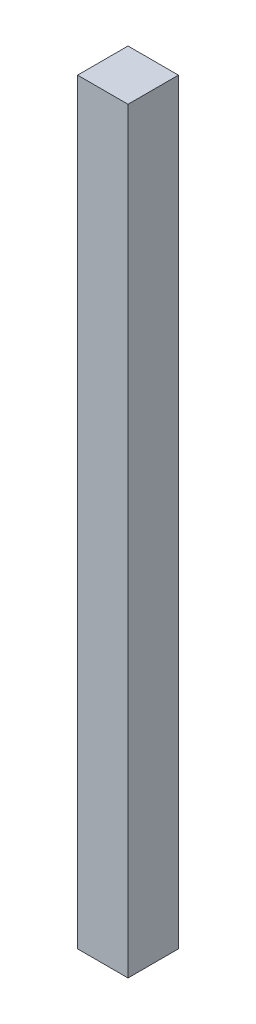
ISO-10303-21;
HEADER;
FILE_DESCRIPTION(('STEP AP214'),'2;1');
FILE_NAME('part.step','',(''),(''),'','','');
FILE_SCHEMA(('AUTOMOTIVE_DESIGN { 1 0 10303 214 1 1 1 1 }'));
ENDSEC;
DATA;
#1=APPLICATION_CONTEXT('core data for automotive mechanical design processes');
#2=APPLICATION_PROTOCOL_DEFINITION('international standard','automotive_design',2000,#1);
#3=PRODUCT_CONTEXT('',#1,'mechanical');
#4=PRODUCT('Part','Part','',(#3));
#5=PRODUCT_RELATED_PRODUCT_CATEGORY('part','',(#4));
#6=PRODUCT_DEFINITION_FORMATION('','',#4);
#7=PRODUCT_DEFINITION_CONTEXT('part definition',#1,'design');
#8=PRODUCT_DEFINITION('design','',#6,#7);
#9=PRODUCT_DEFINITION_SHAPE('','',#8);
#10=(LENGTH_UNIT() NAMED_UNIT(*) SI_UNIT(.MILLI.,.METRE.));
#11=(NAMED_UNIT(*) PLANE_ANGLE_UNIT() SI_UNIT($,.RADIAN.));
#12=(NAMED_UNIT(*) SI_UNIT($,.STERADIAN.) SOLID_ANGLE_UNIT());
#13=UNCERTAINTY_MEASURE_WITH_UNIT(LENGTH_MEASURE(1.E-05),#10,'distance_accuracy_value','');
#14=(GEOMETRIC_REPRESENTATION_CONTEXT(3) GLOBAL_UNCERTAINTY_ASSIGNED_CONTEXT((#13)) GLOBAL_UNIT_ASSIGNED_CONTEXT((#10,
#11,#12)) REPRESENTATION_CONTEXT('',''));
#15=CARTESIAN_POINT('',(0.,0.,0.));
#16=DIRECTION('',(0.,0.,1.));
#17=DIRECTION('',(1.,0.,0.));
#18=AXIS2_PLACEMENT_3D('',#15,#16,#17);
#19=CARTESIAN_POINT('',(-100.,-3000.,100.));
#20=DIRECTION('',(-1.,0.,0.));
#21=DIRECTION('',(0.,0.,1.));
#22=AXIS2_PLACEMENT_3D('',#19,#20,#21);
#23=PLANE('',#22);
#24=DIRECTION('',(0.,0.,1.));
#25=VECTOR('',#24,1.);
#26=CARTESIAN_POINT('',(-100.,0.,100.));
#27=LINE('',#26,#25);
#28=CARTESIAN_POINT('',(-100.,0.,-100.));
#29=VERTEX_POINT('',#28);
#30=CARTESIAN_POINT('',(-100.,0.,100.));
#31=VERTEX_POINT('',#30);
#32=EDGE_CURVE('E99',#29,#31,#27,.T.);
#33=ORIENTED_EDGE('',*,*,#32,.F.);
#34=DIRECTION('',(0.,1.,0.));
#35=VECTOR('',#34,1.);
#36=CARTESIAN_POINT('',(-100.,-3000.,-100.));
#37=LINE('',#36,#35);
#38=CARTESIAN_POINT('',(-100.,-3000.,-100.));
#39=VERTEX_POINT('',#38);
#40=EDGE_CURVE('E11',#39,#29,#37,.T.);
#41=ORIENTED_EDGE('',*,*,#40,.F.);
#42=DIRECTION('',(0.,0.,1.));
#43=VECTOR('',#42,1.);
#44=CARTESIAN_POINT('',(-100.,-3000.,100.));
#45=LINE('',#44,#43);
#46=CARTESIAN_POINT('',(-100.,-3000.,100.));
#47=VERTEX_POINT('',#46);
#48=EDGE_CURVE('E93',#39,#47,#45,.T.);
#49=ORIENTED_EDGE('',*,*,#48,.T.);
#50=DIRECTION('',(0.,1.,0.));
#51=VECTOR('',#50,1.);
#52=CARTESIAN_POINT('',(-100.,-3000.,100.));
#53=LINE('',#52,#51);
#54=EDGE_CURVE('E38',#47,#31,#53,.T.);
#55=ORIENTED_EDGE('',*,*,#54,.T.);
#56=EDGE_LOOP('',(#33,#41,#49,#55));
#57=FACE_BOUND('',#56,.T.);
#58=ADVANCED_FACE('F35',(#57),#23,.T.);
#59=CARTESIAN_POINT('',(100.,-3000.,-100.));
#60=DIRECTION('',(0.,0.,-1.));
#61=DIRECTION('',(-1.,0.,0.));
#62=AXIS2_PLACEMENT_3D('',#59,#60,#61);
#63=PLANE('',#62);
#64=DIRECTION('',(-1.,0.,0.));
#65=VECTOR('',#64,1.);
#66=CARTESIAN_POINT('',(100.,0.,-100.));
#67=LINE('',#66,#65);
#68=CARTESIAN_POINT('',(100.,0.,-100.));
#69=VERTEX_POINT('',#68);
#70=EDGE_CURVE('E95',#69,#29,#67,.T.);
#71=ORIENTED_EDGE('',*,*,#70,.F.);
#72=DIRECTION('',(0.,1.,0.));
#73=VECTOR('',#72,1.);
#74=CARTESIAN_POINT('',(100.,-3000.,-100.));
#75=LINE('',#74,#73);
#76=CARTESIAN_POINT('',(100.,-3000.,-100.));
#77=VERTEX_POINT('',#76);
#78=EDGE_CURVE('E44',#77,#69,#75,.T.);
#79=ORIENTED_EDGE('',*,*,#78,.F.);
#80=DIRECTION('',(-1.,0.,0.));
#81=VECTOR('',#80,1.);
#82=CARTESIAN_POINT('',(100.,-3000.,-100.));
#83=LINE('',#82,#81);
#84=EDGE_CURVE('E90',#77,#39,#83,.T.);
#85=ORIENTED_EDGE('',*,*,#84,.T.);
#86=ORIENTED_EDGE('',*,*,#40,.T.);
#87=EDGE_LOOP('',(#71,#79,#85,#86));
#88=FACE_BOUND('',#87,.T.);
#89=ADVANCED_FACE('F109',(#88),#63,.T.);
#90=CARTESIAN_POINT('',(100.,-3000.,100.));
#91=DIRECTION('',(1.,0.,0.));
#92=DIRECTION('',(0.,0.,-1.));
#93=AXIS2_PLACEMENT_3D('',#90,#91,#92);
#94=PLANE('',#93);
#95=DIRECTION('',(0.,0.,-1.));
#96=VECTOR('',#95,1.);
#97=CARTESIAN_POINT('',(100.,0.,100.));
#98=LINE('',#97,#96);
#99=CARTESIAN_POINT('',(100.,0.,100.));
#100=VERTEX_POINT('',#99);
#101=EDGE_CURVE('E85',#100,#69,#98,.T.);
#102=ORIENTED_EDGE('',*,*,#101,.F.);
#103=DIRECTION('',(0.,1.,0.));
#104=VECTOR('',#103,1.);
#105=CARTESIAN_POINT('',(100.,-3000.,100.));
#106=LINE('',#105,#104);
#107=CARTESIAN_POINT('',(100.,-3000.,100.));
#108=VERTEX_POINT('',#107);
#109=EDGE_CURVE('E80',#108,#100,#106,.T.);
#110=ORIENTED_EDGE('',*,*,#109,.F.);
#111=DIRECTION('',(0.,0.,-1.));
#112=VECTOR('',#111,1.);
#113=CARTESIAN_POINT('',(100.,-3000.,100.));
#114=LINE('',#113,#112);
#115=EDGE_CURVE('E83',#108,#77,#114,.T.);
#116=ORIENTED_EDGE('',*,*,#115,.T.);
#117=ORIENTED_EDGE('',*,*,#78,.T.);
#118=EDGE_LOOP('',(#102,#110,#116,#117));
#119=FACE_BOUND('',#118,.T.);
#120=ADVANCED_FACE('F82',(#119),#94,.T.);
#121=CARTESIAN_POINT('',(100.,-3000.,100.));
#122=DIRECTION('',(0.,0.,1.));
#123=DIRECTION('',(1.,0.,0.));
#124=AXIS2_PLACEMENT_3D('',#121,#122,#123);
#125=PLANE('',#124);
#126=DIRECTION('',(1.,0.,0.));
#127=VECTOR('',#126,1.);
#128=CARTESIAN_POINT('',(100.,0.,100.));
#129=LINE('',#128,#127);
#130=EDGE_CURVE('E102',#31,#100,#129,.T.);
#131=ORIENTED_EDGE('',*,*,#130,.F.);
#132=ORIENTED_EDGE('',*,*,#54,.F.);
#133=DIRECTION('',(1.,0.,0.));
#134=VECTOR('',#133,1.);
#135=CARTESIAN_POINT('',(100.,-3000.,100.));
#136=LINE('',#135,#134);
#137=EDGE_CURVE('E89',#47,#108,#136,.T.);
#138=ORIENTED_EDGE('',*,*,#137,.T.);
#139=ORIENTED_EDGE('',*,*,#109,.T.);
#140=EDGE_LOOP('',(#131,#132,#138,#139));
#141=FACE_BOUND('',#140,.T.);
#142=ADVANCED_FACE('F92',(#141),#125,.T.);
#143=CARTESIAN_POINT('',(0.,-3000.,0.));
#144=DIRECTION('',(0.,1.,0.));
#145=DIRECTION('',(0.,0.,1.));
#146=AXIS2_PLACEMENT_3D('',#143,#144,#145);
#147=PLANE('',#146);
#148=ORIENTED_EDGE('',*,*,#48,.F.);
#149=ORIENTED_EDGE('',*,*,#84,.F.);
#150=ORIENTED_EDGE('',*,*,#115,.F.);
#151=ORIENTED_EDGE('',*,*,#137,.F.);
#152=EDGE_LOOP('',(#148,#149,#150,#151));
#153=FACE_BOUND('',#152,.T.);
#154=ADVANCED_FACE('F88',(#153),#147,.F.);
#155=CARTESIAN_POINT('',(0.,0.,0.));
#156=DIRECTION('',(0.,1.,0.));
#157=DIRECTION('',(0.,0.,1.));
#158=AXIS2_PLACEMENT_3D('',#155,#156,#157);
#159=PLANE('',#158);
#160=ORIENTED_EDGE('',*,*,#32,.T.);
#161=ORIENTED_EDGE('',*,*,#130,.T.);
#162=ORIENTED_EDGE('',*,*,#101,.T.);
#163=ORIENTED_EDGE('',*,*,#70,.T.);
#164=EDGE_LOOP('',(#160,#161,#162,#163));
#165=FACE_BOUND('',#164,.T.);
#166=ADVANCED_FACE('F108',(#165),#159,.T.);
#167=CLOSED_SHELL('',(#58,#89,#120,#142,#154,#166));
#168=MANIFOLD_SOLID_BREP('B2',#167);
#169=ADVANCED_BREP_SHAPE_REPRESENTATION('',(#18,#168),#14);
#170=SHAPE_DEFINITION_REPRESENTATION(#9,#169);
ENDSEC;
END-ISO-10303-21;
